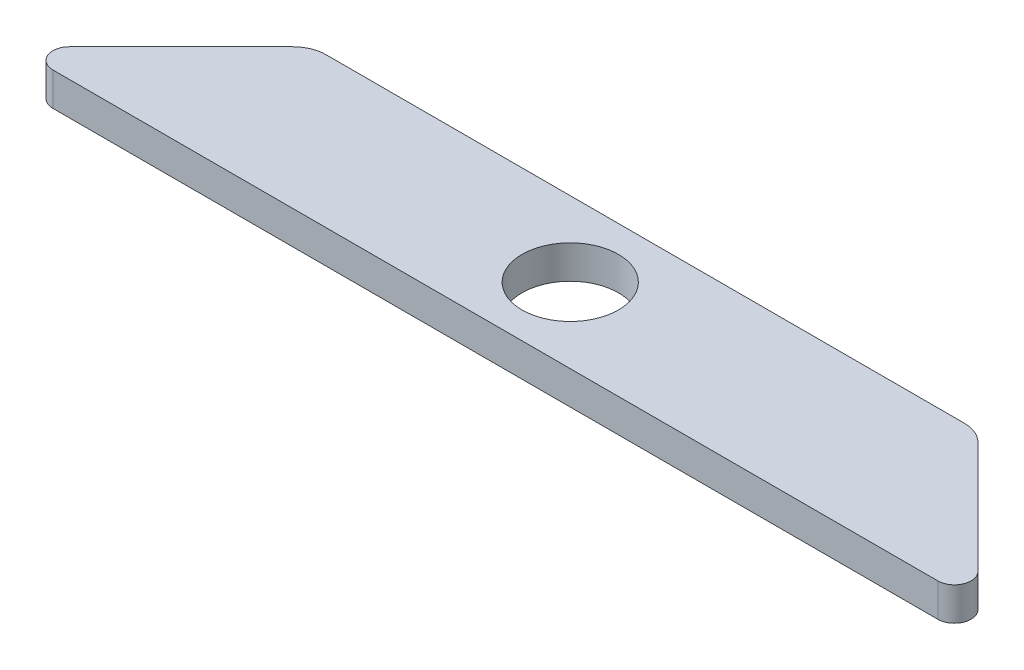
ISO-10303-21;
HEADER;
FILE_DESCRIPTION(('STEP AP214'),'2;1');
FILE_NAME('part.step','',(''),(''),'','','');
FILE_SCHEMA(('AUTOMOTIVE_DESIGN { 1 0 10303 214 1 1 1 1 }'));
ENDSEC;
DATA;
#1=APPLICATION_CONTEXT('core data for automotive mechanical design processes');
#2=APPLICATION_PROTOCOL_DEFINITION('international standard','automotive_design',2000,#1);
#3=PRODUCT_CONTEXT('',#1,'mechanical');
#4=PRODUCT('Part','Part','',(#3));
#5=PRODUCT_RELATED_PRODUCT_CATEGORY('part','',(#4));
#6=PRODUCT_DEFINITION_FORMATION('','',#4);
#7=PRODUCT_DEFINITION_CONTEXT('part definition',#1,'design');
#8=PRODUCT_DEFINITION('design','',#6,#7);
#9=PRODUCT_DEFINITION_SHAPE('','',#8);
#10=(LENGTH_UNIT() NAMED_UNIT(*) SI_UNIT(.MILLI.,.METRE.));
#11=(NAMED_UNIT(*) PLANE_ANGLE_UNIT() SI_UNIT($,.RADIAN.));
#12=(NAMED_UNIT(*) SI_UNIT($,.STERADIAN.) SOLID_ANGLE_UNIT());
#13=UNCERTAINTY_MEASURE_WITH_UNIT(LENGTH_MEASURE(1.E-05),#10,'distance_accuracy_value','');
#14=(GEOMETRIC_REPRESENTATION_CONTEXT(3) GLOBAL_UNCERTAINTY_ASSIGNED_CONTEXT((#13)) GLOBAL_UNIT_ASSIGNED_CONTEXT((#10,
#11,#12)) REPRESENTATION_CONTEXT('',''));
#15=CARTESIAN_POINT('',(0.,0.,0.));
#16=DIRECTION('',(0.,0.,1.));
#17=DIRECTION('',(1.,0.,0.));
#18=AXIS2_PLACEMENT_3D('',#15,#16,#17);
#19=CARTESIAN_POINT('',(9.5857864376269,0.5,-0.969669914110147));
#20=DIRECTION('',(0.,-1.,0.));
#21=DIRECTION('',(0.,0.,-1.));
#22=AXIS2_PLACEMENT_3D('',#19,#20,#21);
#23=CYLINDRICAL_SURFACE('',#22,0.999999999999977);
#24=CARTESIAN_POINT('',(9.5857864376269,-0.5,-0.969669914110147));
#25=DIRECTION('',(0.,1.,0.));
#26=DIRECTION('',(0.,0.,1.));
#27=AXIS2_PLACEMENT_3D('',#24,#25,#26);
#28=CIRCLE('',#27,0.999999999999977);
#29=CARTESIAN_POINT('',(10.2928932188134,-0.5,-1.67677669529671));
#30=VERTEX_POINT('',#29);
#31=CARTESIAN_POINT('',(9.5857864376269,-0.5,-1.96966991411009));
#32=VERTEX_POINT('',#31);
#33=EDGE_CURVE('E132',#30,#32,#28,.T.);
#34=ORIENTED_EDGE('',*,*,#33,.T.);
#35=DIRECTION('',(0.,-1.,0.));
#36=VECTOR('',#35,1.);
#37=CARTESIAN_POINT('',(9.5857864376269,0.5,-1.96966991411009));
#38=LINE('',#37,#36);
#39=CARTESIAN_POINT('',(9.5857864376269,0.5,-1.96966991411009));
#40=VERTEX_POINT('',#39);
#41=EDGE_CURVE('E11',#40,#32,#38,.T.);
#42=ORIENTED_EDGE('',*,*,#41,.F.);
#43=CARTESIAN_POINT('',(9.5857864376269,0.5,-0.969669914110147));
#44=DIRECTION('',(0.,1.,0.));
#45=DIRECTION('',(0.,0.,1.));
#46=AXIS2_PLACEMENT_3D('',#43,#44,#45);
#47=CIRCLE('',#46,0.999999999999977);
#48=CARTESIAN_POINT('',(10.2928932188134,0.5,-1.67677669529671));
#49=VERTEX_POINT('',#48);
#50=EDGE_CURVE('E147',#49,#40,#47,.T.);
#51=ORIENTED_EDGE('',*,*,#50,.F.);
#52=DIRECTION('',(0.,-1.,0.));
#53=VECTOR('',#52,1.);
#54=CARTESIAN_POINT('',(10.2928932188134,0.5,-1.67677669529671));
#55=LINE('',#54,#53);
#56=EDGE_CURVE('E128',#49,#30,#55,.T.);
#57=ORIENTED_EDGE('',*,*,#56,.T.);
#58=EDGE_LOOP('',(#34,#42,#51,#57));
#59=FACE_BOUND('',#58,.T.);
#60=ADVANCED_FACE('F36',(#59),#23,.T.);
#61=CARTESIAN_POINT('',(9.5857864376269,0.5,-1.96966991411009));
#62=DIRECTION('',(0.,0.,1.));
#63=DIRECTION('',(1.,0.,0.));
#64=AXIS2_PLACEMENT_3D('',#61,#62,#63);
#65=PLANE('',#64);
#66=DIRECTION('',(-1.,0.,0.));
#67=VECTOR('',#66,1.);
#68=CARTESIAN_POINT('',(9.5857864376269,-0.5,-1.96966991411009));
#69=LINE('',#68,#67);
#70=CARTESIAN_POINT('',(-9.5857864376269,-0.5,-1.96966991411009));
#71=VERTEX_POINT('',#70);
#72=EDGE_CURVE('E135',#32,#71,#69,.T.);
#73=ORIENTED_EDGE('',*,*,#72,.T.);
#74=DIRECTION('',(0.,-1.,0.));
#75=VECTOR('',#74,1.);
#76=CARTESIAN_POINT('',(-9.5857864376269,0.5,-1.96966991411009));
#77=LINE('',#76,#75);
#78=CARTESIAN_POINT('',(-9.5857864376269,0.5,-1.96966991411009));
#79=VERTEX_POINT('',#78);
#80=EDGE_CURVE('E44',#79,#71,#77,.T.);
#81=ORIENTED_EDGE('',*,*,#80,.F.);
#82=DIRECTION('',(-1.,0.,0.));
#83=VECTOR('',#82,1.);
#84=CARTESIAN_POINT('',(9.5857864376269,0.5,-1.96966991411009));
#85=LINE('',#84,#83);
#86=EDGE_CURVE('E95',#40,#79,#85,.T.);
#87=ORIENTED_EDGE('',*,*,#86,.F.);
#88=ORIENTED_EDGE('',*,*,#41,.T.);
#89=EDGE_LOOP('',(#73,#81,#87,#88));
#90=FACE_BOUND('',#89,.T.);
#91=ADVANCED_FACE('F201',(#90),#65,.F.);
#92=CARTESIAN_POINT('',(-9.5857864376269,0.5,-0.969669914110147));
#93=DIRECTION('',(0.,-1.,0.));
#94=DIRECTION('',(0.,0.,-1.));
#95=AXIS2_PLACEMENT_3D('',#92,#93,#94);
#96=CYLINDRICAL_SURFACE('',#95,0.999999999999939);
#97=CARTESIAN_POINT('',(-9.5857864376269,-0.5,-0.969669914110147));
#98=DIRECTION('',(0.,1.,0.));
#99=DIRECTION('',(0.,0.,1.));
#100=AXIS2_PLACEMENT_3D('',#97,#98,#99);
#101=CIRCLE('',#100,0.999999999999939);
#102=CARTESIAN_POINT('',(-10.2928932188134,-0.5,-1.67677669529664));
#103=VERTEX_POINT('',#102);
#104=EDGE_CURVE('E138',#71,#103,#101,.T.);
#105=ORIENTED_EDGE('',*,*,#104,.T.);
#106=DIRECTION('',(0.,-1.,0.));
#107=VECTOR('',#106,1.);
#108=CARTESIAN_POINT('',(-10.2928932188134,0.5,-1.67677669529664));
#109=LINE('',#108,#107);
#110=CARTESIAN_POINT('',(-10.2928932188134,0.5,-1.67677669529664));
#111=VERTEX_POINT('',#110);
#112=EDGE_CURVE('E154',#111,#103,#109,.T.);
#113=ORIENTED_EDGE('',*,*,#112,.F.);
#114=CARTESIAN_POINT('',(-9.5857864376269,0.5,-0.969669914110147));
#115=DIRECTION('',(0.,1.,0.));
#116=DIRECTION('',(0.,0.,1.));
#117=AXIS2_PLACEMENT_3D('',#114,#115,#116);
#118=CIRCLE('',#117,0.999999999999939);
#119=EDGE_CURVE('E162',#79,#111,#118,.T.);
#120=ORIENTED_EDGE('',*,*,#119,.F.);
#121=ORIENTED_EDGE('',*,*,#80,.T.);
#122=EDGE_LOOP('',(#105,#113,#120,#121));
#123=FACE_BOUND('',#122,.T.);
#124=ADVANCED_FACE('F160',(#123),#96,.T.);
#125=CARTESIAN_POINT('',(-10.2928932188134,0.5,-1.67677669529664));
#126=DIRECTION('',(0.707106781186564,0.,0.707106781186531));
#127=DIRECTION('',(0.707106781186531,0.,-0.707106781186564));
#128=AXIS2_PLACEMENT_3D('',#125,#126,#127);
#129=PLANE('',#128);
#130=DIRECTION('',(-0.707106781186531,0.,0.707106781186564));
#131=VECTOR('',#130,1.);
#132=CARTESIAN_POINT('',(-10.2928932188134,-0.5,-1.67677669529664));
#133=LINE('',#132,#131);
#134=CARTESIAN_POINT('',(-13.6464466094066,-0.5,1.67677669529664));
#135=VERTEX_POINT('',#134);
#136=EDGE_CURVE('E140',#103,#135,#133,.T.);
#137=ORIENTED_EDGE('',*,*,#136,.T.);
#138=DIRECTION('',(0.,-1.,0.));
#139=VECTOR('',#138,1.);
#140=CARTESIAN_POINT('',(-13.6464466094066,0.5,1.67677669529664));
#141=LINE('',#140,#139);
#142=CARTESIAN_POINT('',(-13.6464466094066,0.5,1.67677669529664));
#143=VERTEX_POINT('',#142);
#144=EDGE_CURVE('E151',#143,#135,#141,.T.);
#145=ORIENTED_EDGE('',*,*,#144,.F.);
#146=DIRECTION('',(-0.707106781186531,0.,0.707106781186564));
#147=VECTOR('',#146,1.);
#148=CARTESIAN_POINT('',(-10.2928932188134,0.5,-1.67677669529664));
#149=LINE('',#148,#147);
#150=EDGE_CURVE('E174',#111,#143,#149,.T.);
#151=ORIENTED_EDGE('',*,*,#150,.F.);
#152=ORIENTED_EDGE('',*,*,#112,.T.);
#153=EDGE_LOOP('',(#137,#145,#151,#152));
#154=FACE_BOUND('',#153,.T.);
#155=ADVANCED_FACE('F170',(#154),#129,.F.);
#156=CARTESIAN_POINT('',(-13.2928932188134,0.5,2.0303300858899));
#157=DIRECTION('',(0.,-1.,0.));
#158=DIRECTION('',(0.,0.,-1.));
#159=AXIS2_PLACEMENT_3D('',#156,#157,#158);
#160=CYLINDRICAL_SURFACE('',#159,0.499999999999987);
#161=CARTESIAN_POINT('',(-13.2928932188134,-0.5,2.0303300858899));
#162=DIRECTION('',(0.,1.,0.));
#163=DIRECTION('',(0.,0.,-1.));
#164=AXIS2_PLACEMENT_3D('',#161,#162,#163);
#165=CIRCLE('',#164,0.499999999999987);
#166=CARTESIAN_POINT('',(-13.2928932188133,-0.5,2.53033008588996));
#167=VERTEX_POINT('',#166);
#168=EDGE_CURVE('E142',#135,#167,#165,.T.);
#169=ORIENTED_EDGE('',*,*,#168,.T.);
#170=DIRECTION('',(0.,-1.,0.));
#171=VECTOR('',#170,1.);
#172=CARTESIAN_POINT('',(-13.2928932188133,0.5,2.53033008588996));
#173=LINE('',#172,#171);
#174=CARTESIAN_POINT('',(-13.2928932188133,0.5,2.53033008588996));
#175=VERTEX_POINT('',#174);
#176=EDGE_CURVE('E123',#175,#167,#173,.T.);
#177=ORIENTED_EDGE('',*,*,#176,.F.);
#178=CARTESIAN_POINT('',(-13.2928932188134,0.5,2.0303300858899));
#179=DIRECTION('',(0.,1.,0.));
#180=DIRECTION('',(0.,0.,-1.));
#181=AXIS2_PLACEMENT_3D('',#178,#179,#180);
#182=CIRCLE('',#181,0.499999999999987);
#183=EDGE_CURVE('E114',#143,#175,#182,.T.);
#184=ORIENTED_EDGE('',*,*,#183,.F.);
#185=ORIENTED_EDGE('',*,*,#144,.T.);
#186=EDGE_LOOP('',(#169,#177,#184,#185));
#187=FACE_BOUND('',#186,.T.);
#188=ADVANCED_FACE('F173',(#187),#160,.T.);
#189=CARTESIAN_POINT('',(-13.2928932188133,0.5,2.53033008588996));
#190=DIRECTION('',(0.,0.,-1.));
#191=DIRECTION('',(-1.,0.,0.));
#192=AXIS2_PLACEMENT_3D('',#189,#190,#191);
#193=PLANE('',#192);
#194=DIRECTION('',(1.,0.,0.));
#195=VECTOR('',#194,1.);
#196=CARTESIAN_POINT('',(-13.2928932188133,-0.5,2.53033008588996));
#197=LINE('',#196,#195);
#198=CARTESIAN_POINT('',(13.2928932188136,-0.5,2.53033008588994));
#199=VERTEX_POINT('',#198);
#200=EDGE_CURVE('E122',#167,#199,#197,.T.);
#201=ORIENTED_EDGE('',*,*,#200,.T.);
#202=DIRECTION('',(0.,-1.,0.));
#203=VECTOR('',#202,1.);
#204=CARTESIAN_POINT('',(13.2928932188136,0.5,2.53033008588994));
#205=LINE('',#204,#203);
#206=CARTESIAN_POINT('',(13.2928932188136,0.5,2.53033008588994));
#207=VERTEX_POINT('',#206);
#208=EDGE_CURVE('E119',#207,#199,#205,.T.);
#209=ORIENTED_EDGE('',*,*,#208,.F.);
#210=DIRECTION('',(1.,0.,0.));
#211=VECTOR('',#210,1.);
#212=CARTESIAN_POINT('',(-13.2928932188133,0.5,2.53033008588996));
#213=LINE('',#212,#211);
#214=EDGE_CURVE('E108',#175,#207,#213,.T.);
#215=ORIENTED_EDGE('',*,*,#214,.F.);
#216=ORIENTED_EDGE('',*,*,#176,.T.);
#217=EDGE_LOOP('',(#201,#209,#215,#216));
#218=FACE_BOUND('',#217,.T.);
#219=ADVANCED_FACE('F120',(#218),#193,.F.);
#220=CARTESIAN_POINT('',(13.2928932188135,0.5,2.03033008588991));
#221=DIRECTION('',(0.,-1.,0.));
#222=DIRECTION('',(0.,0.,-1.));
#223=AXIS2_PLACEMENT_3D('',#220,#221,#222);
#224=CYLINDRICAL_SURFACE('',#223,0.500000000000031);
#225=CARTESIAN_POINT('',(13.2928932188135,-0.5,2.03033008588991));
#226=DIRECTION('',(0.,1.,0.));
#227=DIRECTION('',(0.,0.,1.));
#228=AXIS2_PLACEMENT_3D('',#225,#226,#227);
#229=CIRCLE('',#228,0.500000000000031);
#230=CARTESIAN_POINT('',(13.6464466094069,-0.5,1.67677669529668));
#231=VERTEX_POINT('',#230);
#232=EDGE_CURVE('E81',#199,#231,#229,.T.);
#233=ORIENTED_EDGE('',*,*,#232,.T.);
#234=DIRECTION('',(0.,-1.,0.));
#235=VECTOR('',#234,1.);
#236=CARTESIAN_POINT('',(13.6464466094069,0.5,1.67677669529668));
#237=LINE('',#236,#235);
#238=CARTESIAN_POINT('',(13.6464466094069,0.5,1.67677669529668));
#239=VERTEX_POINT('',#238);
#240=EDGE_CURVE('E124',#239,#231,#237,.T.);
#241=ORIENTED_EDGE('',*,*,#240,.F.);
#242=CARTESIAN_POINT('',(13.2928932188135,0.5,2.03033008588991));
#243=DIRECTION('',(0.,1.,0.));
#244=DIRECTION('',(0.,0.,1.));
#245=AXIS2_PLACEMENT_3D('',#242,#243,#244);
#246=CIRCLE('',#245,0.500000000000031);
#247=EDGE_CURVE('E112',#207,#239,#246,.T.);
#248=ORIENTED_EDGE('',*,*,#247,.F.);
#249=ORIENTED_EDGE('',*,*,#208,.T.);
#250=EDGE_LOOP('',(#233,#241,#248,#249));
#251=FACE_BOUND('',#250,.T.);
#252=ADVANCED_FACE('F126',(#251),#224,.T.);
#253=CARTESIAN_POINT('',(13.6464466094069,0.5,1.67677669529668));
#254=DIRECTION('',(-0.707106781186544,0.,0.707106781186551));
#255=DIRECTION('',(0.707106781186551,0.,0.707106781186544));
#256=AXIS2_PLACEMENT_3D('',#253,#254,#255);
#257=PLANE('',#256);
#258=DIRECTION('',(-0.707106781186551,0.,-0.707106781186544));
#259=VECTOR('',#258,1.);
#260=CARTESIAN_POINT('',(13.6464466094069,-0.5,1.67677669529668));
#261=LINE('',#260,#259);
#262=EDGE_CURVE('E87',#231,#30,#261,.T.);
#263=ORIENTED_EDGE('',*,*,#262,.T.);
#264=ORIENTED_EDGE('',*,*,#56,.F.);
#265=DIRECTION('',(-0.707106781186551,0.,-0.707106781186544));
#266=VECTOR('',#265,1.);
#267=CARTESIAN_POINT('',(13.6464466094069,0.5,1.67677669529668));
#268=LINE('',#267,#266);
#269=EDGE_CURVE('E52',#239,#49,#268,.T.);
#270=ORIENTED_EDGE('',*,*,#269,.F.);
#271=ORIENTED_EDGE('',*,*,#240,.T.);
#272=EDGE_LOOP('',(#263,#264,#270,#271));
#273=FACE_BOUND('',#272,.T.);
#274=ADVANCED_FACE('F190',(#273),#257,.F.);
#275=CARTESIAN_POINT('',(9.5857864376269,0.5,-0.969669914110147));
#276=DIRECTION('',(0.,1.,0.));
#277=DIRECTION('',(0.,0.,1.));
#278=AXIS2_PLACEMENT_3D('',#275,#276,#277);
#279=PLANE('',#278);
#280=CARTESIAN_POINT('',(0.,0.5,0.280330085889906));
#281=DIRECTION('',(0.,1.,0.));
#282=DIRECTION('',(0.,0.,1.));
#283=AXIS2_PLACEMENT_3D('',#280,#281,#282);
#284=CIRCLE('',#283,1.4478);
#285=CARTESIAN_POINT('',(0.,0.5,1.72813008588991));
#286=VERTEX_POINT('',#285);
#287=EDGE_CURVE('E182',#286,#286,#284,.T.);
#288=ORIENTED_EDGE('',*,*,#287,.F.);
#289=EDGE_LOOP('',(#288));
#290=FACE_BOUND('',#289,.T.);
#291=ORIENTED_EDGE('',*,*,#50,.T.);
#292=ORIENTED_EDGE('',*,*,#86,.T.);
#293=ORIENTED_EDGE('',*,*,#119,.T.);
#294=ORIENTED_EDGE('',*,*,#150,.T.);
#295=ORIENTED_EDGE('',*,*,#183,.T.);
#296=ORIENTED_EDGE('',*,*,#214,.T.);
#297=ORIENTED_EDGE('',*,*,#247,.T.);
#298=ORIENTED_EDGE('',*,*,#269,.T.);
#299=EDGE_LOOP('',(#291,#292,#293,#294,#295,#296,#297,#298));
#300=FACE_BOUND('',#299,.T.);
#301=ADVANCED_FACE('F110',(#290,#300),#279,.T.);
#302=CARTESIAN_POINT('',(9.5857864376269,-0.5,-0.969669914110147));
#303=DIRECTION('',(0.,1.,0.));
#304=DIRECTION('',(0.,0.,1.));
#305=AXIS2_PLACEMENT_3D('',#302,#303,#304);
#306=PLANE('',#305);
#307=CARTESIAN_POINT('',(0.,-0.5,0.280330085889906));
#308=DIRECTION('',(0.,1.,0.));
#309=DIRECTION('',(0.,0.,1.));
#310=AXIS2_PLACEMENT_3D('',#307,#308,#309);
#311=CIRCLE('',#310,1.4478);
#312=CARTESIAN_POINT('',(0.,-0.5,1.72813008588991));
#313=VERTEX_POINT('',#312);
#314=EDGE_CURVE('E136',#313,#313,#311,.F.);
#315=ORIENTED_EDGE('',*,*,#314,.F.);
#316=EDGE_LOOP('',(#315));
#317=FACE_BOUND('',#316,.T.);
#318=ORIENTED_EDGE('',*,*,#33,.F.);
#319=ORIENTED_EDGE('',*,*,#262,.F.);
#320=ORIENTED_EDGE('',*,*,#232,.F.);
#321=ORIENTED_EDGE('',*,*,#200,.F.);
#322=ORIENTED_EDGE('',*,*,#168,.F.);
#323=ORIENTED_EDGE('',*,*,#136,.F.);
#324=ORIENTED_EDGE('',*,*,#104,.F.);
#325=ORIENTED_EDGE('',*,*,#72,.F.);
#326=EDGE_LOOP('',(#318,#319,#320,#321,#322,#323,#324,#325));
#327=FACE_BOUND('',#326,.T.);
#328=ADVANCED_FACE('F166',(#317,#327),#306,.F.);
#329=CARTESIAN_POINT('',(0.,-0.501,0.280330085889906));
#330=DIRECTION('',(0.,1.,0.));
#331=DIRECTION('',(0.,0.,1.));
#332=AXIS2_PLACEMENT_3D('',#329,#330,#331);
#333=CYLINDRICAL_SURFACE('',#332,1.4478);
#334=ORIENTED_EDGE('',*,*,#287,.T.);
#335=EDGE_LOOP('',(#334));
#336=FACE_BOUND('',#335,.T.);
#337=ORIENTED_EDGE('',*,*,#314,.T.);
#338=EDGE_LOOP('',(#337));
#339=FACE_BOUND('',#338,.T.);
#340=ADVANCED_FACE('F186',(#336,#339),#333,.F.);
#341=CLOSED_SHELL('',(#60,#91,#124,#155,#188,#219,#252,#274,#301,#328,#340));
#342=MANIFOLD_SOLID_BREP('B2',#341);
#343=ADVANCED_BREP_SHAPE_REPRESENTATION('',(#18,#342),#14);
#344=SHAPE_DEFINITION_REPRESENTATION(#9,#343);
ENDSEC;
END-ISO-10303-21;
